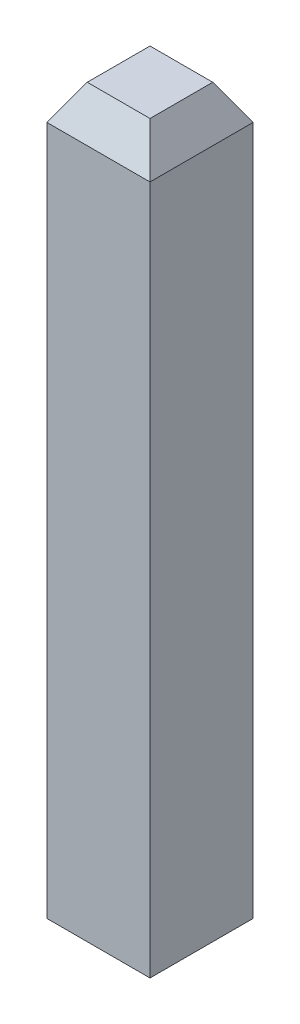
ISO-10303-21;
HEADER;
FILE_DESCRIPTION(('STEP AP214'),'2;1');
FILE_NAME('part.step','',(''),(''),'','','');
FILE_SCHEMA(('AUTOMOTIVE_DESIGN { 1 0 10303 214 1 1 1 1 }'));
ENDSEC;
DATA;
#1=APPLICATION_CONTEXT('core data for automotive mechanical design processes');
#2=APPLICATION_PROTOCOL_DEFINITION('international standard','automotive_design',2000,#1);
#3=PRODUCT_CONTEXT('',#1,'mechanical');
#4=PRODUCT('Part','Part','',(#3));
#5=PRODUCT_RELATED_PRODUCT_CATEGORY('part','',(#4));
#6=PRODUCT_DEFINITION_FORMATION('','',#4);
#7=PRODUCT_DEFINITION_CONTEXT('part definition',#1,'design');
#8=PRODUCT_DEFINITION('design','',#6,#7);
#9=PRODUCT_DEFINITION_SHAPE('','',#8);
#10=(LENGTH_UNIT() NAMED_UNIT(*) SI_UNIT(.MILLI.,.METRE.));
#11=(NAMED_UNIT(*) PLANE_ANGLE_UNIT() SI_UNIT($,.RADIAN.));
#12=(NAMED_UNIT(*) SI_UNIT($,.STERADIAN.) SOLID_ANGLE_UNIT());
#13=UNCERTAINTY_MEASURE_WITH_UNIT(LENGTH_MEASURE(1.E-05),#10,'distance_accuracy_value','');
#14=(GEOMETRIC_REPRESENTATION_CONTEXT(3) GLOBAL_UNCERTAINTY_ASSIGNED_CONTEXT((#13)) GLOBAL_UNIT_ASSIGNED_CONTEXT((#10,
#11,#12)) REPRESENTATION_CONTEXT('',''));
#15=CARTESIAN_POINT('',(0.,0.,0.));
#16=DIRECTION('',(0.,0.,1.));
#17=DIRECTION('',(1.,0.,0.));
#18=AXIS2_PLACEMENT_3D('',#15,#16,#17);
#19=CARTESIAN_POINT('',(1.57,6.8,0.18));
#20=DIRECTION('',(-1.,0.,0.));
#21=DIRECTION('',(0.,0.,1.));
#22=AXIS2_PLACEMENT_3D('',#19,#20,#21);
#23=PLANE('',#22);
#24=DIRECTION('',(0.,-1.,0.));
#25=VECTOR('',#24,1.);
#26=CARTESIAN_POINT('',(1.57,6.8,0.18));
#27=LINE('',#26,#25);
#28=CARTESIAN_POINT('',(1.57,6.58349364905389,0.18));
#29=VERTEX_POINT('',#28);
#30=CARTESIAN_POINT('',(1.57,2.3,0.18));
#31=VERTEX_POINT('',#30);
#32=EDGE_CURVE('E11',#29,#31,#27,.T.);
#33=ORIENTED_EDGE('',*,*,#32,.F.);
#34=DIRECTION('',(0.,0.,1.));
#35=VECTOR('',#34,1.);
#36=CARTESIAN_POINT('',(1.57,6.58349364905389,0.18));
#37=LINE('',#36,#35);
#38=CARTESIAN_POINT('',(1.57,6.58349364905389,0.82));
#39=VERTEX_POINT('',#38);
#40=EDGE_CURVE('E23',#29,#39,#37,.T.);
#41=ORIENTED_EDGE('',*,*,#40,.T.);
#42=DIRECTION('',(0.,-1.,0.));
#43=VECTOR('',#42,1.);
#44=CARTESIAN_POINT('',(1.57,6.8,0.82));
#45=LINE('',#44,#43);
#46=CARTESIAN_POINT('',(1.57,2.3,0.82));
#47=VERTEX_POINT('',#46);
#48=EDGE_CURVE('E116',#39,#47,#45,.T.);
#49=ORIENTED_EDGE('',*,*,#48,.T.);
#50=DIRECTION('',(0.,0.,-1.));
#51=VECTOR('',#50,1.);
#52=CARTESIAN_POINT('',(1.57,2.3,0.18));
#53=LINE('',#52,#51);
#54=EDGE_CURVE('E114',#47,#31,#53,.T.);
#55=ORIENTED_EDGE('',*,*,#54,.T.);
#56=EDGE_LOOP('',(#33,#41,#49,#55));
#57=FACE_BOUND('',#56,.T.);
#58=ADVANCED_FACE('F16',(#57),#23,.F.);
#59=CARTESIAN_POINT('',(0.93,6.8,0.18));
#60=DIRECTION('',(0.,0.,1.));
#61=DIRECTION('',(1.,0.,0.));
#62=AXIS2_PLACEMENT_3D('',#59,#60,#61);
#63=PLANE('',#62);
#64=DIRECTION('',(0.,-1.,0.));
#65=VECTOR('',#64,1.);
#66=CARTESIAN_POINT('',(0.93,6.8,0.18));
#67=LINE('',#66,#65);
#68=CARTESIAN_POINT('',(0.93,6.58349364905389,0.18));
#69=VERTEX_POINT('',#68);
#70=CARTESIAN_POINT('',(0.93,2.3,0.18));
#71=VERTEX_POINT('',#70);
#72=EDGE_CURVE('E112',#69,#71,#67,.T.);
#73=ORIENTED_EDGE('',*,*,#72,.F.);
#74=DIRECTION('',(1.,0.,0.));
#75=VECTOR('',#74,1.);
#76=CARTESIAN_POINT('',(0.93,6.58349364905389,0.18));
#77=LINE('',#76,#75);
#78=EDGE_CURVE('E110',#69,#29,#77,.T.);
#79=ORIENTED_EDGE('',*,*,#78,.T.);
#80=ORIENTED_EDGE('',*,*,#32,.T.);
#81=DIRECTION('',(-1.,0.,0.));
#82=VECTOR('',#81,1.);
#83=CARTESIAN_POINT('',(0.93,2.3,0.18));
#84=LINE('',#83,#82);
#85=EDGE_CURVE('E108',#31,#71,#84,.T.);
#86=ORIENTED_EDGE('',*,*,#85,.T.);
#87=EDGE_LOOP('',(#73,#79,#80,#86));
#88=FACE_BOUND('',#87,.T.);
#89=ADVANCED_FACE('F138',(#88),#63,.F.);
#90=CARTESIAN_POINT('',(0.93,6.8,0.82));
#91=DIRECTION('',(1.,0.,0.));
#92=DIRECTION('',(0.,0.,-1.));
#93=AXIS2_PLACEMENT_3D('',#90,#91,#92);
#94=PLANE('',#93);
#95=DIRECTION('',(0.,-1.,0.));
#96=VECTOR('',#95,1.);
#97=CARTESIAN_POINT('',(0.93,6.8,0.82));
#98=LINE('',#97,#96);
#99=CARTESIAN_POINT('',(0.93,6.58349364905389,0.82));
#100=VERTEX_POINT('',#99);
#101=CARTESIAN_POINT('',(0.93,2.3,0.82));
#102=VERTEX_POINT('',#101);
#103=EDGE_CURVE('E106',#100,#102,#98,.T.);
#104=ORIENTED_EDGE('',*,*,#103,.F.);
#105=DIRECTION('',(0.,0.,-1.));
#106=VECTOR('',#105,1.);
#107=CARTESIAN_POINT('',(0.93,6.58349364905389,0.82));
#108=LINE('',#107,#106);
#109=EDGE_CURVE('E103',#100,#69,#108,.T.);
#110=ORIENTED_EDGE('',*,*,#109,.T.);
#111=ORIENTED_EDGE('',*,*,#72,.T.);
#112=DIRECTION('',(0.,0.,1.));
#113=VECTOR('',#112,1.);
#114=CARTESIAN_POINT('',(0.93,2.3,0.82));
#115=LINE('',#114,#113);
#116=EDGE_CURVE('E100',#71,#102,#115,.T.);
#117=ORIENTED_EDGE('',*,*,#116,.T.);
#118=EDGE_LOOP('',(#104,#110,#111,#117));
#119=FACE_BOUND('',#118,.T.);
#120=ADVANCED_FACE('F133',(#119),#94,.F.);
#121=CARTESIAN_POINT('',(1.57,6.8,0.82));
#122=DIRECTION('',(0.,0.,-1.));
#123=DIRECTION('',(-1.,0.,0.));
#124=AXIS2_PLACEMENT_3D('',#121,#122,#123);
#125=PLANE('',#124);
#126=ORIENTED_EDGE('',*,*,#48,.F.);
#127=DIRECTION('',(-1.,0.,0.));
#128=VECTOR('',#127,1.);
#129=CARTESIAN_POINT('',(1.57,6.58349364905389,0.82));
#130=LINE('',#129,#128);
#131=EDGE_CURVE('E97',#39,#100,#130,.T.);
#132=ORIENTED_EDGE('',*,*,#131,.T.);
#133=ORIENTED_EDGE('',*,*,#103,.T.);
#134=DIRECTION('',(1.,0.,0.));
#135=VECTOR('',#134,1.);
#136=CARTESIAN_POINT('',(1.57,2.3,0.82));
#137=LINE('',#136,#135);
#138=EDGE_CURVE('E94',#102,#47,#137,.T.);
#139=ORIENTED_EDGE('',*,*,#138,.T.);
#140=EDGE_LOOP('',(#126,#132,#133,#139));
#141=FACE_BOUND('',#140,.T.);
#142=ADVANCED_FACE('F121',(#141),#125,.F.);
#143=CARTESIAN_POINT('',(0.,6.8,0.));
#144=DIRECTION('',(0.,-1.,0.));
#145=DIRECTION('',(0.,0.,-1.));
#146=AXIS2_PLACEMENT_3D('',#143,#144,#145);
#147=PLANE('',#146);
#148=DIRECTION('',(0.,0.,1.));
#149=VECTOR('',#148,1.);
#150=CARTESIAN_POINT('',(1.055,6.8,0.));
#151=LINE('',#150,#149);
#152=CARTESIAN_POINT('',(1.055,6.8,0.305000000000001));
#153=VERTEX_POINT('',#152);
#154=CARTESIAN_POINT('',(1.055,6.8,0.694999999999999));
#155=VERTEX_POINT('',#154);
#156=EDGE_CURVE('E92',#153,#155,#151,.T.);
#157=ORIENTED_EDGE('',*,*,#156,.T.);
#158=DIRECTION('',(1.,0.,0.));
#159=VECTOR('',#158,1.);
#160=CARTESIAN_POINT('',(0.,6.8,0.694999999999999));
#161=LINE('',#160,#159);
#162=CARTESIAN_POINT('',(1.445,6.8,0.694999999999999));
#163=VERTEX_POINT('',#162);
#164=EDGE_CURVE('E71',#155,#163,#161,.T.);
#165=ORIENTED_EDGE('',*,*,#164,.T.);
#166=DIRECTION('',(0.,0.,-1.));
#167=VECTOR('',#166,1.);
#168=CARTESIAN_POINT('',(1.445,6.8,0.));
#169=LINE('',#168,#167);
#170=CARTESIAN_POINT('',(1.445,6.8,0.305000000000001));
#171=VERTEX_POINT('',#170);
#172=EDGE_CURVE('E65',#163,#171,#169,.T.);
#173=ORIENTED_EDGE('',*,*,#172,.T.);
#174=DIRECTION('',(-1.,0.,0.));
#175=VECTOR('',#174,1.);
#176=CARTESIAN_POINT('',(0.,6.8,0.305000000000001));
#177=LINE('',#176,#175);
#178=EDGE_CURVE('E68',#171,#153,#177,.T.);
#179=ORIENTED_EDGE('',*,*,#178,.T.);
#180=EDGE_LOOP('',(#157,#165,#173,#179));
#181=FACE_BOUND('',#180,.T.);
#182=ADVANCED_FACE('F67',(#181),#147,.F.);
#183=CARTESIAN_POINT('',(0.,2.3,0.));
#184=DIRECTION('',(0.,-1.,0.));
#185=DIRECTION('',(0.,0.,-1.));
#186=AXIS2_PLACEMENT_3D('',#183,#184,#185);
#187=PLANE('',#186);
#188=ORIENTED_EDGE('',*,*,#54,.F.);
#189=ORIENTED_EDGE('',*,*,#138,.F.);
#190=ORIENTED_EDGE('',*,*,#116,.F.);
#191=ORIENTED_EDGE('',*,*,#85,.F.);
#192=EDGE_LOOP('',(#188,#189,#190,#191));
#193=FACE_BOUND('',#192,.T.);
#194=ADVANCED_FACE('F137',(#193),#187,.T.);
#195=CARTESIAN_POINT('',(0.,6.8,0.305000000000001));
#196=DIRECTION('',(0.,-0.500000000000006,0.866025403784435));
#197=DIRECTION('',(-1.,0.,0.));
#198=AXIS2_PLACEMENT_3D('',#195,#196,#197);
#199=PLANE('',#198);
#200=DIRECTION('',(-0.447213595499962,0.774596669241479,0.447213595499962));
#201=VECTOR('',#200,1.);
#202=CARTESIAN_POINT('',(1.506,6.6943449007383,0.243999999999999));
#203=LINE('',#202,#201);
#204=EDGE_CURVE('E81',#29,#171,#203,.T.);
#205=ORIENTED_EDGE('',*,*,#204,.F.);
#206=ORIENTED_EDGE('',*,*,#78,.F.);
#207=DIRECTION('',(-0.447213595499962,-0.774596669241479,-0.447213595499962));
#208=VECTOR('',#207,1.);
#209=CARTESIAN_POINT('',(0.843999999999997,6.43453727960297,0.0939999999999969));
#210=LINE('',#209,#208);
#211=EDGE_CURVE('E83',#153,#69,#210,.T.);
#212=ORIENTED_EDGE('',*,*,#211,.F.);
#213=ORIENTED_EDGE('',*,*,#178,.F.);
#214=EDGE_LOOP('',(#205,#206,#212,#213));
#215=FACE_BOUND('',#214,.T.);
#216=ADVANCED_FACE('F79',(#215),#199,.F.);
#217=CARTESIAN_POINT('',(1.055,6.8,0.));
#218=DIRECTION('',(0.866025403784435,-0.500000000000006,0.));
#219=DIRECTION('',(0.,0.,1.));
#220=AXIS2_PLACEMENT_3D('',#217,#218,#219);
#221=PLANE('',#220);
#222=ORIENTED_EDGE('',*,*,#211,.T.);
#223=ORIENTED_EDGE('',*,*,#109,.F.);
#224=DIRECTION('',(-0.447213595499962,-0.774596669241479,0.447213595499962));
#225=VECTOR('',#224,1.);
#226=CARTESIAN_POINT('',(1.194,7.04075506225208,0.555999999999997));
#227=LINE('',#226,#225);
#228=EDGE_CURVE('E87',#155,#100,#227,.T.);
#229=ORIENTED_EDGE('',*,*,#228,.F.);
#230=ORIENTED_EDGE('',*,*,#156,.F.);
#231=EDGE_LOOP('',(#222,#223,#229,#230));
#232=FACE_BOUND('',#231,.T.);
#233=ADVANCED_FACE('F131',(#232),#221,.F.);
#234=CARTESIAN_POINT('',(1.445,6.8,0.));
#235=DIRECTION('',(-0.866025403784435,-0.500000000000005,0.));
#236=DIRECTION('',(0.,0.,-1.));
#237=AXIS2_PLACEMENT_3D('',#234,#235,#236);
#238=PLANE('',#237);
#239=ORIENTED_EDGE('',*,*,#204,.T.);
#240=ORIENTED_EDGE('',*,*,#172,.F.);
#241=DIRECTION('',(-0.447213595499962,0.774596669241479,-0.447213595499962));
#242=VECTOR('',#241,1.);
#243=CARTESIAN_POINT('',(1.306,7.04075506225208,0.555999999999997));
#244=LINE('',#243,#242);
#245=EDGE_CURVE('E126',#39,#163,#244,.T.);
#246=ORIENTED_EDGE('',*,*,#245,.F.);
#247=ORIENTED_EDGE('',*,*,#40,.F.);
#248=EDGE_LOOP('',(#239,#240,#246,#247));
#249=FACE_BOUND('',#248,.T.);
#250=ADVANCED_FACE('F85',(#249),#238,.F.);
#251=CARTESIAN_POINT('',(0.,6.8,0.694999999999999));
#252=DIRECTION('',(0.,-0.500000000000005,-0.866025403784435));
#253=DIRECTION('',(1.,0.,0.));
#254=AXIS2_PLACEMENT_3D('',#251,#252,#253);
#255=PLANE('',#254);
#256=ORIENTED_EDGE('',*,*,#228,.T.);
#257=ORIENTED_EDGE('',*,*,#131,.F.);
#258=ORIENTED_EDGE('',*,*,#245,.T.);
#259=ORIENTED_EDGE('',*,*,#164,.F.);
#260=EDGE_LOOP('',(#256,#257,#258,#259));
#261=FACE_BOUND('',#260,.T.);
#262=ADVANCED_FACE('F125',(#261),#255,.F.);
#263=CLOSED_SHELL('',(#58,#89,#120,#142,#182,#194,#216,#233,#250,#262));
#264=MANIFOLD_SOLID_BREP('B1',#263);
#265=ADVANCED_BREP_SHAPE_REPRESENTATION('',(#18,#264),#14);
#266=SHAPE_DEFINITION_REPRESENTATION(#9,#265);
ENDSEC;
END-ISO-10303-21;
